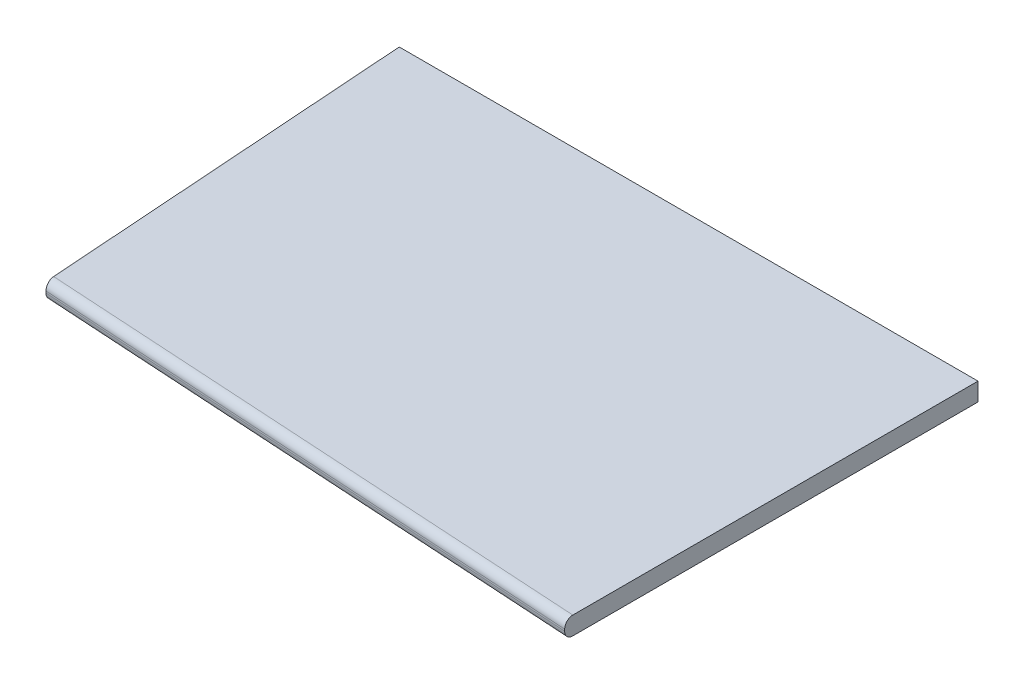
ISO-10303-21;
HEADER;
FILE_DESCRIPTION(('STEP AP214'),'2;1');
FILE_NAME('part.step','',(''),(''),'','','');
FILE_SCHEMA(('AUTOMOTIVE_DESIGN { 1 0 10303 214 1 1 1 1 }'));
ENDSEC;
DATA;
#1=APPLICATION_CONTEXT('core data for automotive mechanical design processes');
#2=APPLICATION_PROTOCOL_DEFINITION('international standard','automotive_design',2000,#1);
#3=PRODUCT_CONTEXT('',#1,'mechanical');
#4=PRODUCT('Part','Part','',(#3));
#5=PRODUCT_RELATED_PRODUCT_CATEGORY('part','',(#4));
#6=PRODUCT_DEFINITION_FORMATION('','',#4);
#7=PRODUCT_DEFINITION_CONTEXT('part definition',#1,'design');
#8=PRODUCT_DEFINITION('design','',#6,#7);
#9=PRODUCT_DEFINITION_SHAPE('','',#8);
#10=(LENGTH_UNIT() NAMED_UNIT(*) SI_UNIT(.MILLI.,.METRE.));
#11=(NAMED_UNIT(*) PLANE_ANGLE_UNIT() SI_UNIT($,.RADIAN.));
#12=(NAMED_UNIT(*) SI_UNIT($,.STERADIAN.) SOLID_ANGLE_UNIT());
#13=UNCERTAINTY_MEASURE_WITH_UNIT(LENGTH_MEASURE(1.E-05),#10,'distance_accuracy_value','');
#14=(GEOMETRIC_REPRESENTATION_CONTEXT(3) GLOBAL_UNCERTAINTY_ASSIGNED_CONTEXT((#13)) GLOBAL_UNIT_ASSIGNED_CONTEXT((#10,
#11,#12)) REPRESENTATION_CONTEXT('',''));
#15=CARTESIAN_POINT('',(0.,0.,0.));
#16=DIRECTION('',(0.,0.,1.));
#17=DIRECTION('',(1.,0.,0.));
#18=AXIS2_PLACEMENT_3D('',#15,#16,#17);
#19=CARTESIAN_POINT('',(3.72989614906705,1.27,53.34));
#20=DIRECTION('',(0.997564050259824,0.,-0.0697564737441291));
#21=DIRECTION('',(-0.0697564737441291,0.,-0.997564050259824));
#22=AXIS2_PLACEMENT_3D('',#19,#20,#21);
#23=PLANE('',#22);
#24=DIRECTION('',(0.0697564737441291,0.,0.997564050259824));
#25=VECTOR('',#24,1.);
#26=CARTESIAN_POINT('',(3.72989614906705,-1.27,53.34));
#27=LINE('',#26,#25);
#28=CARTESIAN_POINT('',(0.,-1.27,0.));
#29=VERTEX_POINT('',#28);
#30=CARTESIAN_POINT('',(3.64948113662124,-1.27,52.1900117449832));
#31=VERTEX_POINT('',#30);
#32=EDGE_CURVE('E125',#29,#31,#27,.T.);
#33=ORIENTED_EDGE('',*,*,#32,.T.);
#34=CARTESIAN_POINT('',(3.64948113662124,-0.127,52.1900117449832));
#35=DIRECTION('',(0.997564050259824,0.,-0.0697564737441291));
#36=DIRECTION('',(-0.0697564737441291,0.,-0.997564050259824));
#37=AXIS2_PLACEMENT_3D('',#34,#35,#36);
#38=ELLIPSE('',#37,1.15279640913006,1.143);
#39=CARTESIAN_POINT('',(3.72989614906705,-0.127,53.34));
#40=VERTEX_POINT('',#39);
#41=EDGE_CURVE('E47',#31,#40,#38,.F.);
#42=ORIENTED_EDGE('',*,*,#41,.T.);
#43=DIRECTION('',(0.,-1.,0.));
#44=VECTOR('',#43,1.);
#45=CARTESIAN_POINT('',(3.72989614906705,1.27,53.34));
#46=LINE('',#45,#44);
#47=CARTESIAN_POINT('',(3.72989614906705,0.127,53.34));
#48=VERTEX_POINT('',#47);
#49=EDGE_CURVE('E135',#48,#40,#46,.T.);
#50=ORIENTED_EDGE('',*,*,#49,.F.);
#51=CARTESIAN_POINT('',(3.64948113662124,0.127,52.1900117449832));
#52=DIRECTION('',(0.997564050259824,0.,-0.0697564737441291));
#53=DIRECTION('',(0.0697564737441291,0.,0.997564050259824));
#54=AXIS2_PLACEMENT_3D('',#51,#52,#53);
#55=ELLIPSE('',#54,1.15279640913006,1.143);
#56=CARTESIAN_POINT('',(3.64948113662124,1.27,52.1900117449832));
#57=VERTEX_POINT('',#56);
#58=EDGE_CURVE('E54',#48,#57,#55,.F.);
#59=ORIENTED_EDGE('',*,*,#58,.T.);
#60=DIRECTION('',(0.0697564737441291,0.,0.997564050259824));
#61=VECTOR('',#60,1.);
#62=CARTESIAN_POINT('',(3.72989614906705,1.27,53.34));
#63=LINE('',#62,#61);
#64=CARTESIAN_POINT('',(0.,1.27,0.));
#65=VERTEX_POINT('',#64);
#66=EDGE_CURVE('E104',#65,#57,#63,.T.);
#67=ORIENTED_EDGE('',*,*,#66,.F.);
#68=DIRECTION('',(0.,-1.,0.));
#69=VECTOR('',#68,1.);
#70=CARTESIAN_POINT('',(0.,1.27,0.));
#71=LINE('',#70,#69);
#72=EDGE_CURVE('E115',#65,#29,#71,.T.);
#73=ORIENTED_EDGE('',*,*,#72,.T.);
#74=EDGE_LOOP('',(#33,#42,#50,#59,#67,#73));
#75=FACE_BOUND('',#74,.T.);
#76=ADVANCED_FACE('F38',(#75),#23,.F.);
#77=CARTESIAN_POINT('',(81.28,1.27,58.0490081779494));
#78=DIRECTION('',(0.0606105008579809,0.,-0.99816149353987));
#79=DIRECTION('',(-0.99816149353987,0.,-0.0606105008579809));
#80=AXIS2_PLACEMENT_3D('',#77,#78,#79);
#81=PLANE('',#80);
#82=ORIENTED_EDGE('',*,*,#49,.T.);
#83=DIRECTION('',(0.99816149353987,0.,0.0606105008579809));
#84=VECTOR('',#83,1.);
#85=CARTESIAN_POINT('',(81.28,-0.127,58.0490081779494));
#86=LINE('',#85,#84);
#87=CARTESIAN_POINT('',(81.28,-0.127,58.0490081779494));
#88=VERTEX_POINT('',#87);
#89=EDGE_CURVE('E142',#40,#88,#86,.T.);
#90=ORIENTED_EDGE('',*,*,#89,.T.);
#91=DIRECTION('',(0.,-1.,0.));
#92=VECTOR('',#91,1.);
#93=CARTESIAN_POINT('',(81.28,1.27,58.0490081779494));
#94=LINE('',#93,#92);
#95=CARTESIAN_POINT('',(81.28,0.127,58.0490081779494));
#96=VERTEX_POINT('',#95);
#97=EDGE_CURVE('E114',#96,#88,#94,.T.);
#98=ORIENTED_EDGE('',*,*,#97,.F.);
#99=DIRECTION('',(0.99816149353987,0.,0.0606105008579809));
#100=VECTOR('',#99,1.);
#101=CARTESIAN_POINT('',(81.28,0.127,58.0490081779494));
#102=LINE('',#101,#100);
#103=EDGE_CURVE('E139',#96,#48,#102,.F.);
#104=ORIENTED_EDGE('',*,*,#103,.T.);
#105=EDGE_LOOP('',(#82,#90,#98,#104));
#106=FACE_BOUND('',#105,.T.);
#107=ADVANCED_FACE('F160',(#106),#81,.F.);
#108=CARTESIAN_POINT('',(81.28,1.27,0.));
#109=DIRECTION('',(-1.,0.,0.));
#110=DIRECTION('',(0.,0.,1.));
#111=AXIS2_PLACEMENT_3D('',#108,#109,#110);
#112=PLANE('',#111);
#113=ORIENTED_EDGE('',*,*,#97,.T.);
#114=CARTESIAN_POINT('',(81.28,-0.127,56.9039028944883));
#115=DIRECTION('',(-1.,0.,0.));
#116=DIRECTION('',(0.,0.,-1.));
#117=AXIS2_PLACEMENT_3D('',#114,#115,#116);
#118=ELLIPSE('',#117,1.14510528346117,1.143);
#119=CARTESIAN_POINT('',(81.28,-1.27,56.9039028944883));
#120=VERTEX_POINT('',#119);
#121=EDGE_CURVE('E149',#88,#120,#118,.F.);
#122=ORIENTED_EDGE('',*,*,#121,.T.);
#123=DIRECTION('',(0.,0.,-1.));
#124=VECTOR('',#123,1.);
#125=CARTESIAN_POINT('',(81.28,-1.27,0.));
#126=LINE('',#125,#124);
#127=CARTESIAN_POINT('',(81.28,-1.27,0.));
#128=VERTEX_POINT('',#127);
#129=EDGE_CURVE('E110',#120,#128,#126,.T.);
#130=ORIENTED_EDGE('',*,*,#129,.T.);
#131=DIRECTION('',(0.,-1.,0.));
#132=VECTOR('',#131,1.);
#133=CARTESIAN_POINT('',(81.28,1.27,0.));
#134=LINE('',#133,#132);
#135=CARTESIAN_POINT('',(81.28,1.27,0.));
#136=VERTEX_POINT('',#135);
#137=EDGE_CURVE('E107',#136,#128,#134,.T.);
#138=ORIENTED_EDGE('',*,*,#137,.F.);
#139=DIRECTION('',(0.,0.,-1.));
#140=VECTOR('',#139,1.);
#141=CARTESIAN_POINT('',(81.28,1.27,0.));
#142=LINE('',#141,#140);
#143=CARTESIAN_POINT('',(81.28,1.27,56.9039028944883));
#144=VERTEX_POINT('',#143);
#145=EDGE_CURVE('E95',#144,#136,#142,.T.);
#146=ORIENTED_EDGE('',*,*,#145,.F.);
#147=CARTESIAN_POINT('',(81.28,0.127,56.9039028944883));
#148=DIRECTION('',(-1.,0.,0.));
#149=DIRECTION('',(0.,0.,1.));
#150=AXIS2_PLACEMENT_3D('',#147,#148,#149);
#151=ELLIPSE('',#150,1.14510528346117,1.143);
#152=EDGE_CURVE('E146',#144,#96,#151,.F.);
#153=ORIENTED_EDGE('',*,*,#152,.T.);
#154=EDGE_LOOP('',(#113,#122,#130,#138,#146,#153));
#155=FACE_BOUND('',#154,.T.);
#156=ADVANCED_FACE('F109',(#155),#112,.F.);
#157=CARTESIAN_POINT('',(0.,1.27,0.));
#158=DIRECTION('',(0.,0.,1.));
#159=DIRECTION('',(1.,0.,0.));
#160=AXIS2_PLACEMENT_3D('',#157,#158,#159);
#161=PLANE('',#160);
#162=DIRECTION('',(-1.,0.,0.));
#163=VECTOR('',#162,1.);
#164=CARTESIAN_POINT('',(0.,-1.27,0.));
#165=LINE('',#164,#163);
#166=EDGE_CURVE('E130',#128,#29,#165,.T.);
#167=ORIENTED_EDGE('',*,*,#166,.T.);
#168=ORIENTED_EDGE('',*,*,#72,.F.);
#169=DIRECTION('',(-1.,0.,0.));
#170=VECTOR('',#169,1.);
#171=CARTESIAN_POINT('',(0.,1.27,0.));
#172=LINE('',#171,#170);
#173=EDGE_CURVE('E99',#136,#65,#172,.T.);
#174=ORIENTED_EDGE('',*,*,#173,.F.);
#175=ORIENTED_EDGE('',*,*,#137,.T.);
#176=EDGE_LOOP('',(#167,#168,#174,#175));
#177=FACE_BOUND('',#176,.T.);
#178=ADVANCED_FACE('F117',(#177),#161,.F.);
#179=CARTESIAN_POINT('',(0.,1.27,0.));
#180=DIRECTION('',(0.,-1.,0.));
#181=DIRECTION('',(0.,0.,-1.));
#182=AXIS2_PLACEMENT_3D('',#179,#180,#181);
#183=PLANE('',#182);
#184=ORIENTED_EDGE('',*,*,#66,.T.);
#185=DIRECTION('',(0.99816149353987,0.,0.0606105008579809));
#186=VECTOR('',#185,1.);
#187=CARTESIAN_POINT('',(-3.14404021898485,1.27,51.7774945975902));
#188=LINE('',#187,#186);
#189=EDGE_CURVE('E11',#57,#144,#188,.T.);
#190=ORIENTED_EDGE('',*,*,#189,.T.);
#191=ORIENTED_EDGE('',*,*,#145,.T.);
#192=ORIENTED_EDGE('',*,*,#173,.T.);
#193=EDGE_LOOP('',(#184,#190,#191,#192));
#194=FACE_BOUND('',#193,.T.);
#195=ADVANCED_FACE('F97',(#194),#183,.F.);
#196=CARTESIAN_POINT('',(0.,-1.27,0.));
#197=DIRECTION('',(0.,-1.,0.));
#198=DIRECTION('',(0.,0.,-1.));
#199=AXIS2_PLACEMENT_3D('',#196,#197,#198);
#200=PLANE('',#199);
#201=ORIENTED_EDGE('',*,*,#129,.F.);
#202=DIRECTION('',(0.99816149353987,0.,0.0606105008579809));
#203=VECTOR('',#202,1.);
#204=CARTESIAN_POINT('',(3.79917395154772,-1.27,52.1991014128839));
#205=LINE('',#204,#203);
#206=EDGE_CURVE('E62',#120,#31,#205,.F.);
#207=ORIENTED_EDGE('',*,*,#206,.T.);
#208=ORIENTED_EDGE('',*,*,#32,.F.);
#209=ORIENTED_EDGE('',*,*,#166,.F.);
#210=EDGE_LOOP('',(#201,#207,#208,#209));
#211=FACE_BOUND('',#210,.T.);
#212=ADVANCED_FACE('F164',(#211),#200,.T.);
#213=CARTESIAN_POINT('',(81.3492778024807,-0.127,56.9081095908334));
#214=DIRECTION('',(-0.99816149353987,0.,-0.0606105008579809));
#215=DIRECTION('',(-0.0606105008579809,0.,0.99816149353987));
#216=AXIS2_PLACEMENT_3D('',#213,#214,#215);
#217=CYLINDRICAL_SURFACE('',#216,1.143);
#218=ORIENTED_EDGE('',*,*,#41,.F.);
#219=ORIENTED_EDGE('',*,*,#206,.F.);
#220=ORIENTED_EDGE('',*,*,#121,.F.);
#221=ORIENTED_EDGE('',*,*,#89,.F.);
#222=EDGE_LOOP('',(#218,#219,#220,#221));
#223=FACE_BOUND('',#222,.T.);
#224=ADVANCED_FACE('F163',(#223),#217,.T.);
#225=CARTESIAN_POINT('',(-3.14404021898485,0.127,51.7774945975902));
#226=DIRECTION('',(0.99816149353987,0.,0.0606105008579809));
#227=DIRECTION('',(0.0606105008579809,0.,-0.99816149353987));
#228=AXIS2_PLACEMENT_3D('',#225,#226,#227);
#229=CYLINDRICAL_SURFACE('',#228,1.143);
#230=ORIENTED_EDGE('',*,*,#58,.F.);
#231=ORIENTED_EDGE('',*,*,#103,.F.);
#232=ORIENTED_EDGE('',*,*,#152,.F.);
#233=ORIENTED_EDGE('',*,*,#189,.F.);
#234=EDGE_LOOP('',(#230,#231,#232,#233));
#235=FACE_BOUND('',#234,.T.);
#236=ADVANCED_FACE('F40',(#235),#229,.T.);
#237=CLOSED_SHELL('',(#76,#107,#156,#178,#195,#212,#224,#236));
#238=MANIFOLD_SOLID_BREP('B2',#237);
#239=ADVANCED_BREP_SHAPE_REPRESENTATION('',(#18,#238),#14);
#240=SHAPE_DEFINITION_REPRESENTATION(#9,#239);
ENDSEC;
END-ISO-10303-21;
